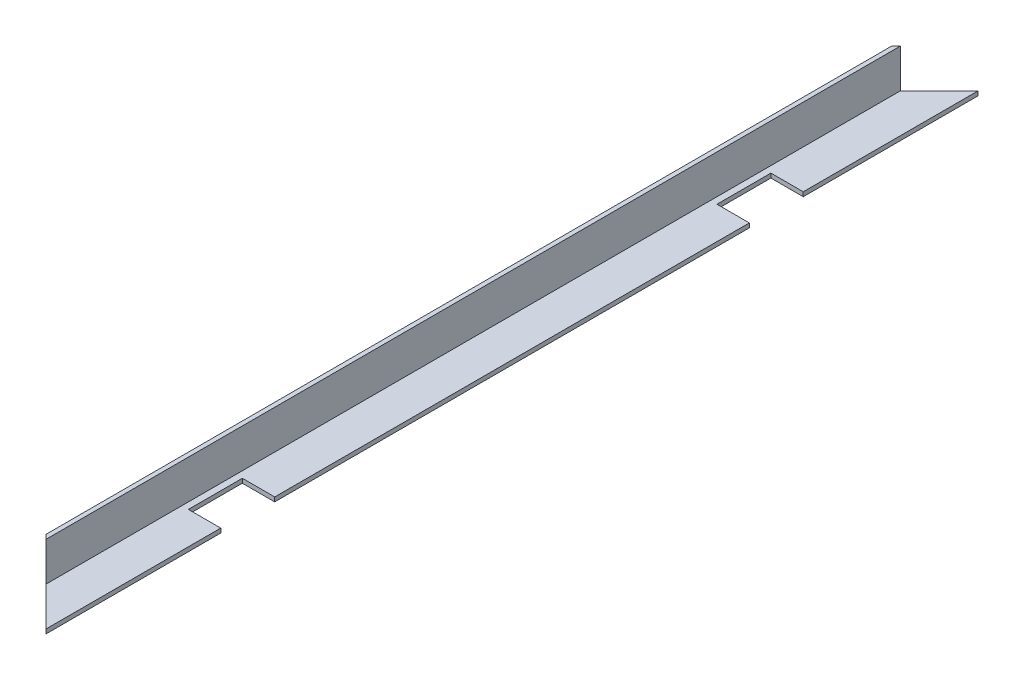
ISO-10303-21;
HEADER;
FILE_DESCRIPTION(('STEP AP214'),'2;1');
FILE_NAME('part.step','',(''),(''),'','','');
FILE_SCHEMA(('AUTOMOTIVE_DESIGN { 1 0 10303 214 1 1 1 1 }'));
ENDSEC;
DATA;
#1=APPLICATION_CONTEXT('core data for automotive mechanical design processes');
#2=APPLICATION_PROTOCOL_DEFINITION('international standard','automotive_design',2000,#1);
#3=PRODUCT_CONTEXT('',#1,'mechanical');
#4=PRODUCT('Part','Part','',(#3));
#5=PRODUCT_RELATED_PRODUCT_CATEGORY('part','',(#4));
#6=PRODUCT_DEFINITION_FORMATION('','',#4);
#7=PRODUCT_DEFINITION_CONTEXT('part definition',#1,'design');
#8=PRODUCT_DEFINITION('design','',#6,#7);
#9=PRODUCT_DEFINITION_SHAPE('','',#8);
#10=(LENGTH_UNIT() NAMED_UNIT(*) SI_UNIT(.MILLI.,.METRE.));
#11=(NAMED_UNIT(*) PLANE_ANGLE_UNIT() SI_UNIT($,.RADIAN.));
#12=(NAMED_UNIT(*) SI_UNIT($,.STERADIAN.) SOLID_ANGLE_UNIT());
#13=UNCERTAINTY_MEASURE_WITH_UNIT(LENGTH_MEASURE(1.E-05),#10,'distance_accuracy_value','');
#14=(GEOMETRIC_REPRESENTATION_CONTEXT(3) GLOBAL_UNCERTAINTY_ASSIGNED_CONTEXT((#13)) GLOBAL_UNIT_ASSIGNED_CONTEXT((#10,
#11,#12)) REPRESENTATION_CONTEXT('',''));
#15=CARTESIAN_POINT('',(0.,0.,0.));
#16=DIRECTION('',(0.,0.,1.));
#17=DIRECTION('',(1.,0.,0.));
#18=AXIS2_PLACEMENT_3D('',#15,#16,#17);
#19=CARTESIAN_POINT('',(20.,2.,432.));
#20=DIRECTION('',(-1.,0.,0.));
#21=DIRECTION('',(0.,0.,1.));
#22=AXIS2_PLACEMENT_3D('',#19,#20,#21);
#23=PLANE('',#22);
#24=DIRECTION('',(0.,0.,-1.));
#25=VECTOR('',#24,1.);
#26=CARTESIAN_POINT('',(20.,0.,432.));
#27=LINE('',#26,#25);
#28=CARTESIAN_POINT('',(20.,0.,326.));
#29=VERTEX_POINT('',#28);
#30=CARTESIAN_POINT('',(20.,0.,106.));
#31=VERTEX_POINT('',#30);
#32=EDGE_CURVE('E237',#29,#31,#27,.T.);
#33=ORIENTED_EDGE('',*,*,#32,.T.);
#34=DIRECTION('',(0.,1.,0.));
#35=VECTOR('',#34,1.);
#36=CARTESIAN_POINT('',(20.,0.,106.));
#37=LINE('',#36,#35);
#38=CARTESIAN_POINT('',(20.,2.,106.));
#39=VERTEX_POINT('',#38);
#40=EDGE_CURVE('E168',#31,#39,#37,.T.);
#41=ORIENTED_EDGE('',*,*,#40,.T.);
#42=DIRECTION('',(0.,0.,-1.));
#43=VECTOR('',#42,1.);
#44=CARTESIAN_POINT('',(20.,2.,432.));
#45=LINE('',#44,#43);
#46=CARTESIAN_POINT('',(20.,2.,326.));
#47=VERTEX_POINT('',#46);
#48=EDGE_CURVE('E235',#47,#39,#45,.T.);
#49=ORIENTED_EDGE('',*,*,#48,.F.);
#50=DIRECTION('',(0.,1.,0.));
#51=VECTOR('',#50,1.);
#52=CARTESIAN_POINT('',(20.,0.,326.));
#53=LINE('',#52,#51);
#54=EDGE_CURVE('E174',#29,#47,#53,.T.);
#55=ORIENTED_EDGE('',*,*,#54,.F.);
#56=EDGE_LOOP('',(#33,#41,#49,#55));
#57=FACE_BOUND('',#56,.T.);
#58=ADVANCED_FACE('F37',(#57),#23,.F.);
#59=CARTESIAN_POINT('',(20.,0.,432.));
#60=VERTEX_POINT('',#59);
#61=CARTESIAN_POINT('',(20.,0.,351.));
#62=VERTEX_POINT('',#61);
#63=EDGE_CURVE('E45',#60,#62,#27,.T.);
#64=ORIENTED_EDGE('',*,*,#63,.T.);
#65=DIRECTION('',(0.,1.,0.));
#66=VECTOR('',#65,1.);
#67=CARTESIAN_POINT('',(20.,0.,351.));
#68=LINE('',#67,#66);
#69=CARTESIAN_POINT('',(20.,2.,351.));
#70=VERTEX_POINT('',#69);
#71=EDGE_CURVE('E181',#62,#70,#68,.T.);
#72=ORIENTED_EDGE('',*,*,#71,.T.);
#73=CARTESIAN_POINT('',(20.,2.,432.));
#74=VERTEX_POINT('',#73);
#75=EDGE_CURVE('E233',#74,#70,#45,.T.);
#76=ORIENTED_EDGE('',*,*,#75,.F.);
#77=DIRECTION('',(0.,1.,0.));
#78=VECTOR('',#77,1.);
#79=CARTESIAN_POINT('',(20.,2.,432.));
#80=LINE('',#79,#78);
#81=EDGE_CURVE('E219',#60,#74,#80,.T.);
#82=ORIENTED_EDGE('',*,*,#81,.F.);
#83=EDGE_LOOP('',(#64,#72,#76,#82));
#84=FACE_BOUND('',#83,.T.);
#85=ADVANCED_FACE('F284',(#84),#23,.F.);
#86=CARTESIAN_POINT('',(0.,20.,432.));
#87=DIRECTION('',(1.,0.,0.));
#88=DIRECTION('',(0.,1.,0.));
#89=AXIS2_PLACEMENT_3D('',#86,#87,#88);
#90=PLANE('',#89);
#91=DIRECTION('',(0.,-1.,0.));
#92=VECTOR('',#91,1.);
#93=CARTESIAN_POINT('',(0.,25.,412.));
#94=LINE('',#93,#92);
#95=CARTESIAN_POINT('',(0.,20.,412.));
#96=VERTEX_POINT('',#95);
#97=CARTESIAN_POINT('',(0.,0.,412.));
#98=VERTEX_POINT('',#97);
#99=EDGE_CURVE('E197',#96,#98,#94,.T.);
#100=ORIENTED_EDGE('',*,*,#99,.F.);
#101=DIRECTION('',(0.,0.,-1.));
#102=VECTOR('',#101,1.);
#103=CARTESIAN_POINT('',(0.,20.,432.));
#104=LINE('',#103,#102);
#105=CARTESIAN_POINT('',(0.,20.,20.0000000000002));
#106=VERTEX_POINT('',#105);
#107=EDGE_CURVE('E221',#96,#106,#104,.T.);
#108=ORIENTED_EDGE('',*,*,#107,.T.);
#109=DIRECTION('',(0.,-1.,0.));
#110=VECTOR('',#109,1.);
#111=CARTESIAN_POINT('',(0.,25.,20.0000000000002));
#112=LINE('',#111,#110);
#113=CARTESIAN_POINT('',(0.,0.,20.0000000000002));
#114=VERTEX_POINT('',#113);
#115=EDGE_CURVE('E171',#106,#114,#112,.T.);
#116=ORIENTED_EDGE('',*,*,#115,.T.);
#117=DIRECTION('',(0.,0.,-1.));
#118=VECTOR('',#117,1.);
#119=CARTESIAN_POINT('',(0.,0.,432.));
#120=LINE('',#119,#118);
#121=EDGE_CURVE('E11',#98,#114,#120,.T.);
#122=ORIENTED_EDGE('',*,*,#121,.F.);
#123=EDGE_LOOP('',(#100,#108,#116,#122));
#124=FACE_BOUND('',#123,.T.);
#125=ADVANCED_FACE('F39',(#124),#90,.F.);
#126=CARTESIAN_POINT('',(0.,0.,432.));
#127=DIRECTION('',(0.,1.,0.));
#128=DIRECTION('',(0.,0.,1.));
#129=AXIS2_PLACEMENT_3D('',#126,#127,#128);
#130=PLANE('',#129);
#131=DIRECTION('',(0.,0.,1.));
#132=VECTOR('',#131,1.);
#133=CARTESIAN_POINT('',(5.,0.,81.));
#134=LINE('',#133,#132);
#135=CARTESIAN_POINT('',(5.,0.,81.));
#136=VERTEX_POINT('',#135);
#137=CARTESIAN_POINT('',(5.,0.,106.));
#138=VERTEX_POINT('',#137);
#139=EDGE_CURVE('E148',#136,#138,#134,.T.);
#140=ORIENTED_EDGE('',*,*,#139,.T.);
#141=DIRECTION('',(1.,0.,0.));
#142=VECTOR('',#141,1.);
#143=CARTESIAN_POINT('',(20.,0.,106.));
#144=LINE('',#143,#142);
#145=EDGE_CURVE('E153',#138,#31,#144,.T.);
#146=ORIENTED_EDGE('',*,*,#145,.T.);
#147=ORIENTED_EDGE('',*,*,#32,.F.);
#148=DIRECTION('',(-1.,0.,0.));
#149=VECTOR('',#148,1.);
#150=CARTESIAN_POINT('',(20.,0.,326.));
#151=LINE('',#150,#149);
#152=CARTESIAN_POINT('',(5.,0.,326.));
#153=VERTEX_POINT('',#152);
#154=EDGE_CURVE('E60',#29,#153,#151,.T.);
#155=ORIENTED_EDGE('',*,*,#154,.T.);
#156=DIRECTION('',(0.,0.,1.));
#157=VECTOR('',#156,1.);
#158=CARTESIAN_POINT('',(5.,0.,351.));
#159=LINE('',#158,#157);
#160=CARTESIAN_POINT('',(5.,0.,351.));
#161=VERTEX_POINT('',#160);
#162=EDGE_CURVE('E193',#153,#161,#159,.T.);
#163=ORIENTED_EDGE('',*,*,#162,.T.);
#164=DIRECTION('',(1.,0.,0.));
#165=VECTOR('',#164,1.);
#166=CARTESIAN_POINT('',(20.,0.,351.));
#167=LINE('',#166,#165);
#168=EDGE_CURVE('E176',#161,#62,#167,.T.);
#169=ORIENTED_EDGE('',*,*,#168,.T.);
#170=ORIENTED_EDGE('',*,*,#63,.F.);
#171=DIRECTION('',(0.707106781186551,0.,0.707106781186544));
#172=VECTOR('',#171,1.);
#173=CARTESIAN_POINT('',(9.9999999999999,0.,422.));
#174=LINE('',#173,#172);
#175=EDGE_CURVE('E216',#98,#60,#174,.T.);
#176=ORIENTED_EDGE('',*,*,#175,.F.);
#177=ORIENTED_EDGE('',*,*,#121,.T.);
#178=DIRECTION('',(-0.707106781186544,0.,0.707106781186551));
#179=VECTOR('',#178,1.);
#180=CARTESIAN_POINT('',(-206.,0.,226.000000000002));
#181=LINE('',#180,#179);
#182=CARTESIAN_POINT('',(20.,0.,0.));
#183=VERTEX_POINT('',#182);
#184=EDGE_CURVE('E208',#183,#114,#181,.T.);
#185=ORIENTED_EDGE('',*,*,#184,.F.);
#186=CARTESIAN_POINT('',(20.,0.,81.));
#187=VERTEX_POINT('',#186);
#188=EDGE_CURVE('E158',#187,#183,#27,.T.);
#189=ORIENTED_EDGE('',*,*,#188,.F.);
#190=DIRECTION('',(-1.,0.,0.));
#191=VECTOR('',#190,1.);
#192=CARTESIAN_POINT('',(20.,0.,81.));
#193=LINE('',#192,#191);
#194=EDGE_CURVE('E52',#187,#136,#193,.T.);
#195=ORIENTED_EDGE('',*,*,#194,.T.);
#196=EDGE_LOOP('',(#140,#146,#147,#155,#163,#169,#170,#176,#177,#185,#189,#195));
#197=FACE_BOUND('',#196,.T.);
#198=ADVANCED_FACE('F156',(#197),#130,.F.);
#199=CARTESIAN_POINT('',(2.,2.,432.));
#200=DIRECTION('',(0.,-1.,0.));
#201=DIRECTION('',(0.,0.,-1.));
#202=AXIS2_PLACEMENT_3D('',#199,#200,#201);
#203=PLANE('',#202);
#204=ORIENTED_EDGE('',*,*,#48,.T.);
#205=DIRECTION('',(1.,0.,0.));
#206=VECTOR('',#205,1.);
#207=CARTESIAN_POINT('',(20.,2.,106.));
#208=LINE('',#207,#206);
#209=CARTESIAN_POINT('',(5.,2.,106.));
#210=VERTEX_POINT('',#209);
#211=EDGE_CURVE('E159',#210,#39,#208,.T.);
#212=ORIENTED_EDGE('',*,*,#211,.F.);
#213=DIRECTION('',(0.,0.,1.));
#214=VECTOR('',#213,1.);
#215=CARTESIAN_POINT('',(5.,2.,81.));
#216=LINE('',#215,#214);
#217=CARTESIAN_POINT('',(5.,2.,81.));
#218=VERTEX_POINT('',#217);
#219=EDGE_CURVE('E161',#218,#210,#216,.T.);
#220=ORIENTED_EDGE('',*,*,#219,.F.);
#221=DIRECTION('',(-1.,0.,0.));
#222=VECTOR('',#221,1.);
#223=CARTESIAN_POINT('',(20.,2.,81.));
#224=LINE('',#223,#222);
#225=CARTESIAN_POINT('',(20.,2.,81.));
#226=VERTEX_POINT('',#225);
#227=EDGE_CURVE('E140',#226,#218,#224,.T.);
#228=ORIENTED_EDGE('',*,*,#227,.F.);
#229=CARTESIAN_POINT('',(20.,2.,0.));
#230=VERTEX_POINT('',#229);
#231=EDGE_CURVE('E232',#226,#230,#45,.T.);
#232=ORIENTED_EDGE('',*,*,#231,.T.);
#233=DIRECTION('',(0.707106781186544,0.,-0.707106781186551));
#234=VECTOR('',#233,1.);
#235=CARTESIAN_POINT('',(-205.,2.,225.000000000002));
#236=LINE('',#235,#234);
#237=CARTESIAN_POINT('',(2.,2.,18.0000000000002));
#238=VERTEX_POINT('',#237);
#239=EDGE_CURVE('E205',#238,#230,#236,.T.);
#240=ORIENTED_EDGE('',*,*,#239,.F.);
#241=DIRECTION('',(0.,0.,-1.));
#242=VECTOR('',#241,1.);
#243=CARTESIAN_POINT('',(2.,2.,432.));
#244=LINE('',#243,#242);
#245=CARTESIAN_POINT('',(2.,2.,414.));
#246=VERTEX_POINT('',#245);
#247=EDGE_CURVE('E229',#246,#238,#244,.T.);
#248=ORIENTED_EDGE('',*,*,#247,.F.);
#249=DIRECTION('',(-0.707106781186551,0.,-0.707106781186544));
#250=VECTOR('',#249,1.);
#251=CARTESIAN_POINT('',(10.9999999999999,2.,423.));
#252=LINE('',#251,#250);
#253=EDGE_CURVE('E214',#74,#246,#252,.T.);
#254=ORIENTED_EDGE('',*,*,#253,.F.);
#255=ORIENTED_EDGE('',*,*,#75,.T.);
#256=DIRECTION('',(1.,0.,0.));
#257=VECTOR('',#256,1.);
#258=CARTESIAN_POINT('',(20.,2.,351.));
#259=LINE('',#258,#257);
#260=CARTESIAN_POINT('',(5.,2.,351.));
#261=VERTEX_POINT('',#260);
#262=EDGE_CURVE('E184',#261,#70,#259,.T.);
#263=ORIENTED_EDGE('',*,*,#262,.F.);
#264=DIRECTION('',(0.,0.,1.));
#265=VECTOR('',#264,1.);
#266=CARTESIAN_POINT('',(5.,2.,351.));
#267=LINE('',#266,#265);
#268=CARTESIAN_POINT('',(5.,2.,326.));
#269=VERTEX_POINT('',#268);
#270=EDGE_CURVE('E186',#269,#261,#267,.T.);
#271=ORIENTED_EDGE('',*,*,#270,.F.);
#272=DIRECTION('',(-1.,0.,0.));
#273=VECTOR('',#272,1.);
#274=CARTESIAN_POINT('',(20.,2.,326.));
#275=LINE('',#274,#273);
#276=EDGE_CURVE('E166',#47,#269,#275,.T.);
#277=ORIENTED_EDGE('',*,*,#276,.F.);
#278=EDGE_LOOP('',(#204,#212,#220,#228,#232,#240,#248,#254,#255,#263,#271,#277));
#279=FACE_BOUND('',#278,.T.);
#280=ADVANCED_FACE('F266',(#279),#203,.F.);
#281=CARTESIAN_POINT('',(2.,20.,432.));
#282=DIRECTION('',(-1.,0.,0.));
#283=DIRECTION('',(0.,-1.,0.));
#284=AXIS2_PLACEMENT_3D('',#281,#282,#283);
#285=PLANE('',#284);
#286=DIRECTION('',(0.,1.,0.));
#287=VECTOR('',#286,1.);
#288=CARTESIAN_POINT('',(2.,20.,414.));
#289=LINE('',#288,#287);
#290=CARTESIAN_POINT('',(2.,20.,414.));
#291=VERTEX_POINT('',#290);
#292=EDGE_CURVE('E212',#246,#291,#289,.T.);
#293=ORIENTED_EDGE('',*,*,#292,.F.);
#294=ORIENTED_EDGE('',*,*,#247,.T.);
#295=DIRECTION('',(0.,-1.,0.));
#296=VECTOR('',#295,1.);
#297=CARTESIAN_POINT('',(2.,20.,18.0000000000002));
#298=LINE('',#297,#296);
#299=CARTESIAN_POINT('',(1.99999999999997,20.,18.0000000000002));
#300=VERTEX_POINT('',#299);
#301=EDGE_CURVE('E203',#300,#238,#298,.T.);
#302=ORIENTED_EDGE('',*,*,#301,.F.);
#303=DIRECTION('',(0.,0.,-1.));
#304=VECTOR('',#303,1.);
#305=CARTESIAN_POINT('',(2.,20.,432.));
#306=LINE('',#305,#304);
#307=EDGE_CURVE('E226',#291,#300,#306,.T.);
#308=ORIENTED_EDGE('',*,*,#307,.F.);
#309=EDGE_LOOP('',(#293,#294,#302,#308));
#310=FACE_BOUND('',#309,.T.);
#311=ADVANCED_FACE('F262',(#310),#285,.F.);
#312=CARTESIAN_POINT('',(2.,20.,432.));
#313=DIRECTION('',(0.,-1.,0.));
#314=DIRECTION('',(0.,0.,-1.));
#315=AXIS2_PLACEMENT_3D('',#312,#313,#314);
#316=PLANE('',#315);
#317=DIRECTION('',(-0.707106781186551,0.,-0.707106781186544));
#318=VECTOR('',#317,1.);
#319=CARTESIAN_POINT('',(10.9999999999999,20.,423.));
#320=LINE('',#319,#318);
#321=EDGE_CURVE('E210',#291,#96,#320,.T.);
#322=ORIENTED_EDGE('',*,*,#321,.F.);
#323=ORIENTED_EDGE('',*,*,#307,.T.);
#324=DIRECTION('',(0.707106781186544,0.,-0.707106781186551));
#325=VECTOR('',#324,1.);
#326=CARTESIAN_POINT('',(-205.,20.,225.000000000002));
#327=LINE('',#326,#325);
#328=EDGE_CURVE('E199',#106,#300,#327,.T.);
#329=ORIENTED_EDGE('',*,*,#328,.F.);
#330=ORIENTED_EDGE('',*,*,#107,.F.);
#331=EDGE_LOOP('',(#322,#323,#329,#330));
#332=FACE_BOUND('',#331,.T.);
#333=ADVANCED_FACE('F258',(#332),#316,.F.);
#334=ORIENTED_EDGE('',*,*,#231,.F.);
#335=DIRECTION('',(0.,1.,0.));
#336=VECTOR('',#335,1.);
#337=CARTESIAN_POINT('',(20.,0.,81.));
#338=LINE('',#337,#336);
#339=EDGE_CURVE('E145',#187,#226,#338,.T.);
#340=ORIENTED_EDGE('',*,*,#339,.F.);
#341=ORIENTED_EDGE('',*,*,#188,.T.);
#342=DIRECTION('',(0.,1.,0.));
#343=VECTOR('',#342,1.);
#344=CARTESIAN_POINT('',(20.,2.,0.));
#345=LINE('',#344,#343);
#346=EDGE_CURVE('E218',#183,#230,#345,.T.);
#347=ORIENTED_EDGE('',*,*,#346,.T.);
#348=EDGE_LOOP('',(#334,#340,#341,#347));
#349=FACE_BOUND('',#348,.T.);
#350=ADVANCED_FACE('F245',(#349),#23,.F.);
#351=CARTESIAN_POINT('',(20.,25.,0.));
#352=DIRECTION('',(-0.707106781186551,0.,-0.707106781186544));
#353=DIRECTION('',(-0.707106781186544,0.,0.707106781186551));
#354=AXIS2_PLACEMENT_3D('',#351,#352,#353);
#355=PLANE('',#354);
#356=ORIENTED_EDGE('',*,*,#184,.T.);
#357=ORIENTED_EDGE('',*,*,#115,.F.);
#358=ORIENTED_EDGE('',*,*,#328,.T.);
#359=ORIENTED_EDGE('',*,*,#301,.T.);
#360=ORIENTED_EDGE('',*,*,#239,.T.);
#361=ORIENTED_EDGE('',*,*,#346,.F.);
#362=EDGE_LOOP('',(#356,#357,#358,#359,#360,#361));
#363=FACE_BOUND('',#362,.T.);
#364=ADVANCED_FACE('F247',(#363),#355,.T.);
#365=CARTESIAN_POINT('',(20.,25.,432.));
#366=DIRECTION('',(-0.707106781186544,0.,0.707106781186551));
#367=DIRECTION('',(0.707106781186551,0.,0.707106781186544));
#368=AXIS2_PLACEMENT_3D('',#365,#366,#367);
#369=PLANE('',#368);
#370=ORIENTED_EDGE('',*,*,#175,.T.);
#371=ORIENTED_EDGE('',*,*,#81,.T.);
#372=ORIENTED_EDGE('',*,*,#253,.T.);
#373=ORIENTED_EDGE('',*,*,#292,.T.);
#374=ORIENTED_EDGE('',*,*,#321,.T.);
#375=ORIENTED_EDGE('',*,*,#99,.T.);
#376=EDGE_LOOP('',(#370,#371,#372,#373,#374,#375));
#377=FACE_BOUND('',#376,.T.);
#378=ADVANCED_FACE('F286',(#377),#369,.T.);
#379=CARTESIAN_POINT('',(20.,0.,351.));
#380=DIRECTION('',(0.,0.,1.));
#381=DIRECTION('',(1.,0.,0.));
#382=AXIS2_PLACEMENT_3D('',#379,#380,#381);
#383=PLANE('',#382);
#384=ORIENTED_EDGE('',*,*,#262,.T.);
#385=ORIENTED_EDGE('',*,*,#71,.F.);
#386=ORIENTED_EDGE('',*,*,#168,.F.);
#387=DIRECTION('',(0.,1.,0.));
#388=VECTOR('',#387,1.);
#389=CARTESIAN_POINT('',(5.,0.,351.));
#390=LINE('',#389,#388);
#391=EDGE_CURVE('E179',#161,#261,#390,.T.);
#392=ORIENTED_EDGE('',*,*,#391,.T.);
#393=EDGE_LOOP('',(#384,#385,#386,#392));
#394=FACE_BOUND('',#393,.T.);
#395=ADVANCED_FACE('F282',(#394),#383,.F.);
#396=CARTESIAN_POINT('',(5.,0.,351.));
#397=DIRECTION('',(-1.,0.,0.));
#398=DIRECTION('',(0.,0.,1.));
#399=AXIS2_PLACEMENT_3D('',#396,#397,#398);
#400=PLANE('',#399);
#401=ORIENTED_EDGE('',*,*,#270,.T.);
#402=ORIENTED_EDGE('',*,*,#391,.F.);
#403=ORIENTED_EDGE('',*,*,#162,.F.);
#404=DIRECTION('',(0.,1.,0.));
#405=VECTOR('',#404,1.);
#406=CARTESIAN_POINT('',(5.,0.,326.));
#407=LINE('',#406,#405);
#408=EDGE_CURVE('E177',#153,#269,#407,.T.);
#409=ORIENTED_EDGE('',*,*,#408,.T.);
#410=EDGE_LOOP('',(#401,#402,#403,#409));
#411=FACE_BOUND('',#410,.T.);
#412=ADVANCED_FACE('F279',(#411),#400,.F.);
#413=CARTESIAN_POINT('',(20.,0.,326.));
#414=DIRECTION('',(0.,0.,-1.));
#415=DIRECTION('',(-1.,0.,0.));
#416=AXIS2_PLACEMENT_3D('',#413,#414,#415);
#417=PLANE('',#416);
#418=ORIENTED_EDGE('',*,*,#276,.T.);
#419=ORIENTED_EDGE('',*,*,#408,.F.);
#420=ORIENTED_EDGE('',*,*,#154,.F.);
#421=ORIENTED_EDGE('',*,*,#54,.T.);
#422=EDGE_LOOP('',(#418,#419,#420,#421));
#423=FACE_BOUND('',#422,.T.);
#424=ADVANCED_FACE('F384',(#423),#417,.F.);
#425=CARTESIAN_POINT('',(20.,0.,106.));
#426=DIRECTION('',(0.,0.,1.));
#427=DIRECTION('',(1.,0.,0.));
#428=AXIS2_PLACEMENT_3D('',#425,#426,#427);
#429=PLANE('',#428);
#430=ORIENTED_EDGE('',*,*,#211,.T.);
#431=ORIENTED_EDGE('',*,*,#40,.F.);
#432=ORIENTED_EDGE('',*,*,#145,.F.);
#433=DIRECTION('',(0.,1.,0.));
#434=VECTOR('',#433,1.);
#435=CARTESIAN_POINT('',(5.,0.,106.));
#436=LINE('',#435,#434);
#437=EDGE_CURVE('E144',#138,#210,#436,.T.);
#438=ORIENTED_EDGE('',*,*,#437,.T.);
#439=EDGE_LOOP('',(#430,#431,#432,#438));
#440=FACE_BOUND('',#439,.T.);
#441=ADVANCED_FACE('F275',(#440),#429,.F.);
#442=CARTESIAN_POINT('',(5.,0.,81.));
#443=DIRECTION('',(-1.,0.,0.));
#444=DIRECTION('',(0.,0.,1.));
#445=AXIS2_PLACEMENT_3D('',#442,#443,#444);
#446=PLANE('',#445);
#447=ORIENTED_EDGE('',*,*,#219,.T.);
#448=ORIENTED_EDGE('',*,*,#437,.F.);
#449=ORIENTED_EDGE('',*,*,#139,.F.);
#450=DIRECTION('',(0.,1.,0.));
#451=VECTOR('',#450,1.);
#452=CARTESIAN_POINT('',(5.,0.,81.));
#453=LINE('',#452,#451);
#454=EDGE_CURVE('E136',#136,#218,#453,.T.);
#455=ORIENTED_EDGE('',*,*,#454,.T.);
#456=EDGE_LOOP('',(#447,#448,#449,#455));
#457=FACE_BOUND('',#456,.T.);
#458=ADVANCED_FACE('F149',(#457),#446,.F.);
#459=CARTESIAN_POINT('',(20.,0.,81.));
#460=DIRECTION('',(0.,0.,-1.));
#461=DIRECTION('',(-1.,0.,0.));
#462=AXIS2_PLACEMENT_3D('',#459,#460,#461);
#463=PLANE('',#462);
#464=ORIENTED_EDGE('',*,*,#227,.T.);
#465=ORIENTED_EDGE('',*,*,#454,.F.);
#466=ORIENTED_EDGE('',*,*,#194,.F.);
#467=ORIENTED_EDGE('',*,*,#339,.T.);
#468=EDGE_LOOP('',(#464,#465,#466,#467));
#469=FACE_BOUND('',#468,.T.);
#470=ADVANCED_FACE('F138',(#469),#463,.F.);
#471=CLOSED_SHELL('',(#58,#85,#125,#198,#280,#311,#333,#350,#364,#378,#395,#412,#424,#441,#458,#470));
#472=MANIFOLD_SOLID_BREP('B2',#471);
#473=ADVANCED_BREP_SHAPE_REPRESENTATION('',(#18,#472),#14);
#474=SHAPE_DEFINITION_REPRESENTATION(#9,#473);
ENDSEC;
END-ISO-10303-21;
